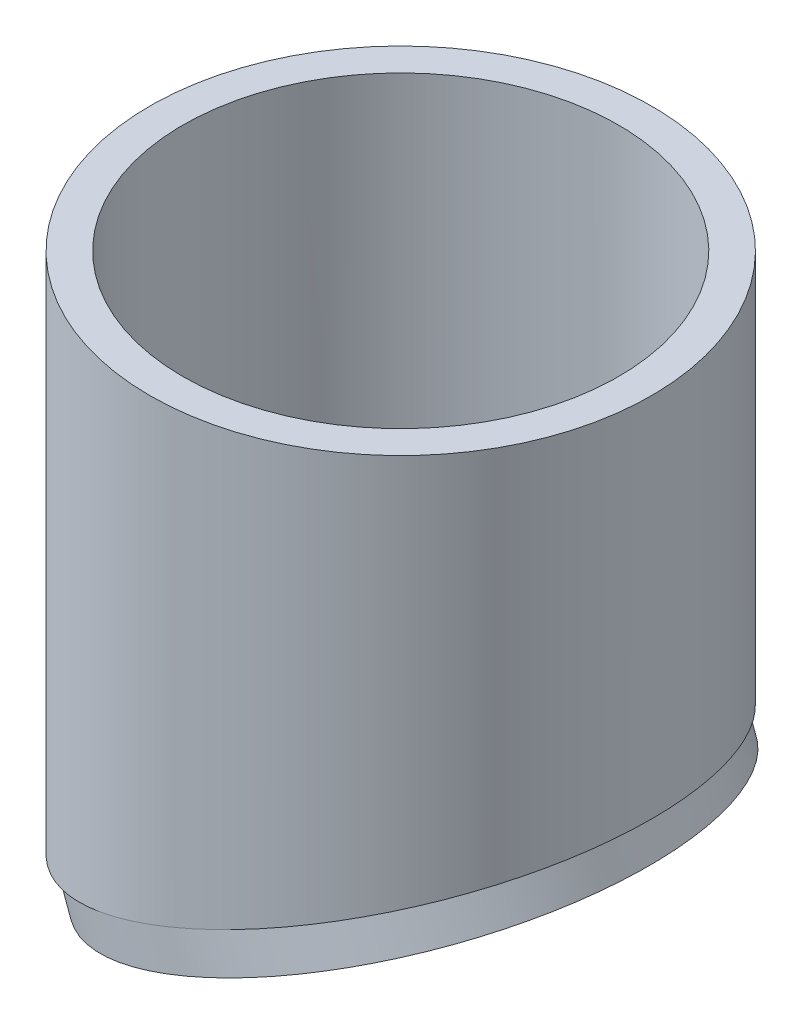
ISO-10303-21;
HEADER;
FILE_DESCRIPTION(('STEP AP214'),'2;1');
FILE_NAME('part.step','',(''),(''),'','','');
FILE_SCHEMA(('AUTOMOTIVE_DESIGN { 1 0 10303 214 1 1 1 1 }'));
ENDSEC;
DATA;
#1=APPLICATION_CONTEXT('core data for automotive mechanical design processes');
#2=APPLICATION_PROTOCOL_DEFINITION('international standard','automotive_design',2000,#1);
#3=PRODUCT_CONTEXT('',#1,'mechanical');
#4=PRODUCT('Part','Part','',(#3));
#5=PRODUCT_RELATED_PRODUCT_CATEGORY('part','',(#4));
#6=PRODUCT_DEFINITION_FORMATION('','',#4);
#7=PRODUCT_DEFINITION_CONTEXT('part definition',#1,'design');
#8=PRODUCT_DEFINITION('design','',#6,#7);
#9=PRODUCT_DEFINITION_SHAPE('','',#8);
#10=(LENGTH_UNIT() NAMED_UNIT(*) SI_UNIT(.MILLI.,.METRE.));
#11=(NAMED_UNIT(*) PLANE_ANGLE_UNIT() SI_UNIT($,.RADIAN.));
#12=(NAMED_UNIT(*) SI_UNIT($,.STERADIAN.) SOLID_ANGLE_UNIT());
#13=UNCERTAINTY_MEASURE_WITH_UNIT(LENGTH_MEASURE(1.E-05),#10,'distance_accuracy_value','');
#14=(GEOMETRIC_REPRESENTATION_CONTEXT(3) GLOBAL_UNCERTAINTY_ASSIGNED_CONTEXT((#13)) GLOBAL_UNIT_ASSIGNED_CONTEXT((#10,
#11,#12)) REPRESENTATION_CONTEXT('',''));
#15=CARTESIAN_POINT('',(0.,0.,0.));
#16=DIRECTION('',(0.,0.,1.));
#17=DIRECTION('',(1.,0.,0.));
#18=AXIS2_PLACEMENT_3D('',#15,#16,#17);
#19=CARTESIAN_POINT('',(0.,0.,0.));
#20=DIRECTION('',(0.342020143325669,-0.939692620785908,0.));
#21=DIRECTION('',(0.939692620785908,0.342020143325669,0.));
#22=AXIS2_PLACEMENT_3D('',#19,#20,#21);
#23=PLANE('',#22);
#24=CARTESIAN_POINT('',(0.,0.,0.));
#25=DIRECTION('',(0.342020143325669,-0.939692620785908,0.));
#26=DIRECTION('',(0.939692620785908,0.342020143325669,0.));
#27=AXIS2_PLACEMENT_3D('',#24,#25,#26);
#28=ELLIPSE('',#27,88.834474330749,83.4771);
#29=CARTESIAN_POINT('',(0.,0.,83.4771));
#30=VERTEX_POINT('',#29);
#31=CARTESIAN_POINT('',(0.,0.,-83.4771));
#32=VERTEX_POINT('',#31);
#33=EDGE_CURVE('E55',#30,#32,#28,.F.);
#34=ORIENTED_EDGE('',*,*,#33,.F.);
#35=CARTESIAN_POINT('',(0.,0.,0.));
#36=DIRECTION('',(-0.342020143325669,0.939692620785908,0.));
#37=DIRECTION('',(-0.939692620785908,-0.342020143325669,0.));
#38=AXIS2_PLACEMENT_3D('',#35,#36,#37);
#39=CIRCLE('',#38,83.4771);
#40=EDGE_CURVE('E43',#30,#32,#39,.T.);
#41=ORIENTED_EDGE('',*,*,#40,.T.);
#42=EDGE_LOOP('',(#34,#41));
#43=FACE_BOUND('',#42,.T.);
#44=ADVANCED_FACE('F32',(#43),#23,.T.);
#45=CARTESIAN_POINT('',(0.,-50.8,0.));
#46=DIRECTION('',(0.,1.,0.));
#47=DIRECTION('',(0.,0.,1.));
#48=AXIS2_PLACEMENT_3D('',#45,#46,#47);
#49=CYLINDRICAL_SURFACE('',#48,83.4771);
#50=CARTESIAN_POINT('',(0.,152.4,0.));
#51=DIRECTION('',(0.,1.,0.));
#52=DIRECTION('',(0.,0.,1.));
#53=AXIS2_PLACEMENT_3D('',#50,#51,#52);
#54=CIRCLE('',#53,83.4771);
#55=CARTESIAN_POINT('',(0.,152.4,83.4771));
#56=VERTEX_POINT('',#55);
#57=EDGE_CURVE('E41',#56,#56,#54,.T.);
#58=ORIENTED_EDGE('',*,*,#57,.F.);
#59=EDGE_LOOP('',(#58));
#60=FACE_BOUND('',#59,.T.);
#61=EDGE_CURVE('E60',#32,#30,#28,.F.);
#62=ORIENTED_EDGE('',*,*,#61,.T.);
#63=ORIENTED_EDGE('',*,*,#33,.T.);
#64=EDGE_LOOP('',(#62,#63));
#65=FACE_BOUND('',#64,.T.);
#66=ADVANCED_FACE('F34',(#60,#65),#49,.T.);
#67=CARTESIAN_POINT('',(0.,-50.8,0.));
#68=DIRECTION('',(0.,1.,0.));
#69=DIRECTION('',(0.,0.,1.));
#70=AXIS2_PLACEMENT_3D('',#67,#68,#69);
#71=CYLINDRICAL_SURFACE('',#70,72.5043);
#72=CARTESIAN_POINT('',(0.,152.4,0.));
#73=DIRECTION('',(0.,1.,0.));
#74=DIRECTION('',(0.,0.,1.));
#75=AXIS2_PLACEMENT_3D('',#72,#73,#74);
#76=CIRCLE('',#75,72.5043);
#77=CARTESIAN_POINT('',(0.,152.4,72.5043));
#78=VERTEX_POINT('',#77);
#79=EDGE_CURVE('E63',#78,#78,#76,.T.);
#80=ORIENTED_EDGE('',*,*,#79,.T.);
#81=EDGE_LOOP('',(#80));
#82=FACE_BOUND('',#81,.T.);
#83=CARTESIAN_POINT('',(0.,0.,0.));
#84=DIRECTION('',(0.342020143325669,-0.939692620785908,0.));
#85=DIRECTION('',(0.939692620785908,0.342020143325669,0.));
#86=AXIS2_PLACEMENT_3D('',#83,#84,#85);
#87=ELLIPSE('',#86,77.1574644689253,72.5043);
#88=CARTESIAN_POINT('',(72.5043,26.3894070563071,0.));
#89=VERTEX_POINT('',#88);
#90=EDGE_CURVE('E36',#89,#89,#87,.F.);
#91=ORIENTED_EDGE('',*,*,#90,.F.);
#92=EDGE_LOOP('',(#91));
#93=FACE_BOUND('',#92,.T.);
#94=ADVANCED_FACE('F74',(#82,#93),#71,.F.);
#95=CARTESIAN_POINT('',(0.,152.4,0.));
#96=DIRECTION('',(0.,1.,0.));
#97=DIRECTION('',(0.,0.,1.));
#98=AXIS2_PLACEMENT_3D('',#95,#96,#97);
#99=PLANE('',#98);
#100=ORIENTED_EDGE('',*,*,#57,.T.);
#101=EDGE_LOOP('',(#100));
#102=FACE_BOUND('',#101,.T.);
#103=ORIENTED_EDGE('',*,*,#79,.F.);
#104=EDGE_LOOP('',(#103));
#105=FACE_BOUND('',#104,.T.);
#106=ADVANCED_FACE('F70',(#102,#105),#99,.T.);
#107=ORIENTED_EDGE('',*,*,#61,.F.);
#108=EDGE_CURVE('E11',#32,#30,#39,.T.);
#109=ORIENTED_EDGE('',*,*,#108,.T.);
#110=EDGE_LOOP('',(#107,#109));
#111=FACE_BOUND('',#110,.T.);
#112=ADVANCED_FACE('F62',(#111),#23,.T.);
#113=CARTESIAN_POINT('',(4.343655820236,-11.934096283981,0.));
#114=DIRECTION('',(-0.342020143325669,0.939692620785908,0.));
#115=DIRECTION('',(-0.939692620785908,-0.342020143325669,0.));
#116=AXIS2_PLACEMENT_3D('',#113,#114,#115);
#117=CYLINDRICAL_SURFACE('',#116,83.4771);
#118=CARTESIAN_POINT('',(4.343655820236,-11.934096283981,0.));
#119=DIRECTION('',(-0.342020143325669,0.939692620785908,0.));
#120=DIRECTION('',(-0.939692620785908,-0.342020143325669,0.));
#121=AXIS2_PLACEMENT_3D('',#118,#119,#120);
#122=CIRCLE('',#121,83.4771);
#123=CARTESIAN_POINT('',(-74.0991590543713,-40.4849459903923,0.));
#124=VERTEX_POINT('',#123);
#125=EDGE_CURVE('E57',#124,#124,#122,.T.);
#126=ORIENTED_EDGE('',*,*,#125,.T.);
#127=EDGE_LOOP('',(#126));
#128=FACE_BOUND('',#127,.T.);
#129=ORIENTED_EDGE('',*,*,#40,.F.);
#130=ORIENTED_EDGE('',*,*,#108,.F.);
#131=EDGE_LOOP('',(#129,#130));
#132=FACE_BOUND('',#131,.T.);
#133=ADVANCED_FACE('F49',(#128,#132),#117,.T.);
#134=CARTESIAN_POINT('',(4.343655820236,-11.934096283981,0.));
#135=DIRECTION('',(-0.342020143325669,0.939692620785908,0.));
#136=DIRECTION('',(-0.939692620785908,-0.342020143325669,0.));
#137=AXIS2_PLACEMENT_3D('',#134,#135,#136);
#138=PLANE('',#137);
#139=CARTESIAN_POINT('',(4.343655820236,-11.934096283981,0.));
#140=DIRECTION('',(-0.342020143325669,0.939692620785908,0.));
#141=DIRECTION('',(0.939692620785908,0.342020143325669,0.));
#142=AXIS2_PLACEMENT_3D('',#139,#140,#141);
#143=ELLIPSE('',#142,77.1574644689253,72.5043);
#144=CARTESIAN_POINT('',(76.847955820236,14.455310772326,0.));
#145=VERTEX_POINT('',#144);
#146=EDGE_CURVE('E58',#145,#145,#143,.T.);
#147=ORIENTED_EDGE('',*,*,#146,.T.);
#148=EDGE_LOOP('',(#147));
#149=FACE_BOUND('',#148,.T.);
#150=ORIENTED_EDGE('',*,*,#125,.F.);
#151=EDGE_LOOP('',(#150));
#152=FACE_BOUND('',#151,.T.);
#153=ADVANCED_FACE('F90',(#149,#152),#138,.F.);
#154=DIRECTION('',(-0.342020143325669,0.939692620785908,0.));
#155=VECTOR('',#154,1.);
#156=SURFACE_OF_LINEAR_EXTRUSION('',#143,#155);
#157=ORIENTED_EDGE('',*,*,#146,.F.);
#158=EDGE_LOOP('',(#157));
#159=FACE_BOUND('',#158,.T.);
#160=ORIENTED_EDGE('',*,*,#90,.T.);
#161=EDGE_LOOP('',(#160));
#162=FACE_BOUND('',#161,.T.);
#163=ADVANCED_FACE('F125',(#159,#162),#156,.F.);
#164=CLOSED_SHELL('',(#44,#66,#94,#106,#112,#133,#153,#163));
#165=MANIFOLD_SOLID_BREP('B2',#164);
#166=ADVANCED_BREP_SHAPE_REPRESENTATION('',(#18,#165),#14);
#167=SHAPE_DEFINITION_REPRESENTATION(#9,#166);
ENDSEC;
END-ISO-10303-21;
